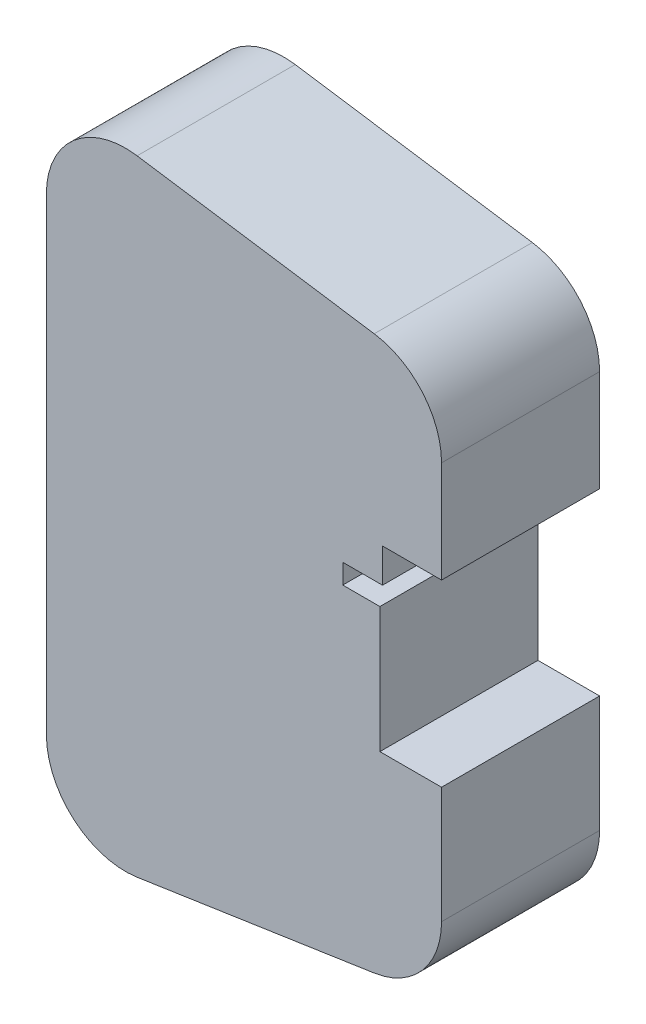
ISO-10303-21;
HEADER;
FILE_DESCRIPTION(('STEP AP214'),'2;1');
FILE_NAME('part.step','',(''),(''),'','','');
FILE_SCHEMA(('AUTOMOTIVE_DESIGN { 1 0 10303 214 1 1 1 1 }'));
ENDSEC;
DATA;
#1=APPLICATION_CONTEXT('core data for automotive mechanical design processes');
#2=APPLICATION_PROTOCOL_DEFINITION('international standard','automotive_design',2000,#1);
#3=PRODUCT_CONTEXT('',#1,'mechanical');
#4=PRODUCT('Part','Part','',(#3));
#5=PRODUCT_RELATED_PRODUCT_CATEGORY('part','',(#4));
#6=PRODUCT_DEFINITION_FORMATION('','',#4);
#7=PRODUCT_DEFINITION_CONTEXT('part definition',#1,'design');
#8=PRODUCT_DEFINITION('design','',#6,#7);
#9=PRODUCT_DEFINITION_SHAPE('','',#8);
#10=(LENGTH_UNIT() NAMED_UNIT(*) SI_UNIT(.MILLI.,.METRE.));
#11=(NAMED_UNIT(*) PLANE_ANGLE_UNIT() SI_UNIT($,.RADIAN.));
#12=(NAMED_UNIT(*) SI_UNIT($,.STERADIAN.) SOLID_ANGLE_UNIT());
#13=UNCERTAINTY_MEASURE_WITH_UNIT(LENGTH_MEASURE(1.E-05),#10,'distance_accuracy_value','');
#14=(GEOMETRIC_REPRESENTATION_CONTEXT(3) GLOBAL_UNCERTAINTY_ASSIGNED_CONTEXT((#13)) GLOBAL_UNIT_ASSIGNED_CONTEXT((#10,
#11,#12)) REPRESENTATION_CONTEXT('',''));
#15=CARTESIAN_POINT('',(0.,0.,0.));
#16=DIRECTION('',(0.,0.,1.));
#17=DIRECTION('',(1.,0.,0.));
#18=AXIS2_PLACEMENT_3D('',#15,#16,#17);
#19=CARTESIAN_POINT('',(50.,-25.1381257919217,20.));
#20=DIRECTION('',(-1.,0.,0.));
#21=DIRECTION('',(0.,0.,1.));
#22=AXIS2_PLACEMENT_3D('',#19,#20,#21);
#23=PLANE('',#22);
#24=DIRECTION('',(0.,1.,0.));
#25=VECTOR('',#24,1.);
#26=CARTESIAN_POINT('',(50.,-25.1381257919217,0.));
#27=LINE('',#26,#25);
#28=CARTESIAN_POINT('',(50.,-25.1381257919217,0.));
#29=VERTEX_POINT('',#28);
#30=CARTESIAN_POINT('',(50.,-10.4028915543573,0.));
#31=VERTEX_POINT('',#30);
#32=EDGE_CURVE('E193',#29,#31,#27,.T.);
#33=ORIENTED_EDGE('',*,*,#32,.T.);
#34=DIRECTION('',(0.,0.,1.));
#35=VECTOR('',#34,1.);
#36=CARTESIAN_POINT('',(50.,-10.4028915543573,0.));
#37=LINE('',#36,#35);
#38=CARTESIAN_POINT('',(50.,-10.4028915543573,20.));
#39=VERTEX_POINT('',#38);
#40=EDGE_CURVE('E242',#31,#39,#37,.T.);
#41=ORIENTED_EDGE('',*,*,#40,.T.);
#42=DIRECTION('',(0.,1.,0.));
#43=VECTOR('',#42,1.);
#44=CARTESIAN_POINT('',(50.,-25.1381257919217,20.));
#45=LINE('',#44,#43);
#46=CARTESIAN_POINT('',(50.,-25.1381257919217,20.));
#47=VERTEX_POINT('',#46);
#48=EDGE_CURVE('E244',#47,#39,#45,.T.);
#49=ORIENTED_EDGE('',*,*,#48,.F.);
#50=DIRECTION('',(0.,0.,-1.));
#51=VECTOR('',#50,1.);
#52=CARTESIAN_POINT('',(50.,-25.1381257919217,20.));
#53=LINE('',#52,#51);
#54=EDGE_CURVE('E224',#47,#29,#53,.T.);
#55=ORIENTED_EDGE('',*,*,#54,.T.);
#56=EDGE_LOOP('',(#33,#41,#49,#55));
#57=FACE_BOUND('',#56,.T.);
#58=ADVANCED_FACE('F32',(#57),#23,.F.);
#59=CARTESIAN_POINT('',(10.,-29.6381257919217,20.));
#60=DIRECTION('',(0.,0.,-1.));
#61=DIRECTION('',(-1.,0.,0.));
#62=AXIS2_PLACEMENT_3D('',#59,#60,#61);
#63=CYLINDRICAL_SURFACE('',#62,9.99999999999999);
#64=CARTESIAN_POINT('',(10.,-29.6381257919217,0.));
#65=DIRECTION('',(0.,0.,1.));
#66=DIRECTION('',(1.,0.,0.));
#67=AXIS2_PLACEMENT_3D('',#64,#65,#66);
#68=CIRCLE('',#67,9.99999999999999);
#69=CARTESIAN_POINT('',(0.,-29.6381257919217,0.));
#70=VERTEX_POINT('',#69);
#71=CARTESIAN_POINT('',(11.4834045293024,-39.5274893206046,0.));
#72=VERTEX_POINT('',#71);
#73=EDGE_CURVE('E258',#70,#72,#68,.T.);
#74=ORIENTED_EDGE('',*,*,#73,.T.);
#75=DIRECTION('',(0.,0.,-1.));
#76=VECTOR('',#75,1.);
#77=CARTESIAN_POINT('',(11.4834045293024,-39.5274893206046,20.));
#78=LINE('',#77,#76);
#79=CARTESIAN_POINT('',(11.4834045293024,-39.5274893206046,20.));
#80=VERTEX_POINT('',#79);
#81=EDGE_CURVE('E11',#80,#72,#78,.T.);
#82=ORIENTED_EDGE('',*,*,#81,.F.);
#83=CARTESIAN_POINT('',(10.,-29.6381257919217,20.));
#84=DIRECTION('',(0.,0.,1.));
#85=DIRECTION('',(1.,0.,0.));
#86=AXIS2_PLACEMENT_3D('',#83,#84,#85);
#87=CIRCLE('',#86,9.99999999999999);
#88=CARTESIAN_POINT('',(0.,-29.6381257919217,20.));
#89=VERTEX_POINT('',#88);
#90=EDGE_CURVE('E208',#89,#80,#87,.T.);
#91=ORIENTED_EDGE('',*,*,#90,.F.);
#92=DIRECTION('',(0.,0.,-1.));
#93=VECTOR('',#92,1.);
#94=CARTESIAN_POINT('',(0.,-29.6381257919217,20.));
#95=LINE('',#94,#93);
#96=EDGE_CURVE('E209',#89,#70,#95,.T.);
#97=ORIENTED_EDGE('',*,*,#96,.T.);
#98=EDGE_LOOP('',(#74,#82,#91,#97));
#99=FACE_BOUND('',#98,.T.);
#100=ADVANCED_FACE('F34',(#99),#63,.T.);
#101=CARTESIAN_POINT('',(41.4834045293024,-35.0274893206046,20.));
#102=DIRECTION('',(-0.148340452930245,0.988936352868298,0.));
#103=DIRECTION('',(-0.988936352868298,-0.148340452930245,0.));
#104=AXIS2_PLACEMENT_3D('',#101,#102,#103);
#105=PLANE('',#104);
#106=DIRECTION('',(0.988936352868298,0.148340452930245,0.));
#107=VECTOR('',#106,1.);
#108=CARTESIAN_POINT('',(41.4834045293024,-35.0274893206046,0.));
#109=LINE('',#108,#107);
#110=CARTESIAN_POINT('',(41.4834045293024,-35.0274893206046,0.));
#111=VERTEX_POINT('',#110);
#112=EDGE_CURVE('E197',#72,#111,#109,.T.);
#113=ORIENTED_EDGE('',*,*,#112,.T.);
#114=DIRECTION('',(0.,0.,-1.));
#115=VECTOR('',#114,1.);
#116=CARTESIAN_POINT('',(41.4834045293024,-35.0274893206046,20.));
#117=LINE('',#116,#115);
#118=CARTESIAN_POINT('',(41.4834045293024,-35.0274893206046,20.));
#119=VERTEX_POINT('',#118);
#120=EDGE_CURVE('E40',#119,#111,#117,.T.);
#121=ORIENTED_EDGE('',*,*,#120,.F.);
#122=DIRECTION('',(0.988936352868298,0.148340452930245,0.));
#123=VECTOR('',#122,1.);
#124=CARTESIAN_POINT('',(41.4834045293024,-35.0274893206046,20.));
#125=LINE('',#124,#123);
#126=EDGE_CURVE('E263',#80,#119,#125,.T.);
#127=ORIENTED_EDGE('',*,*,#126,.F.);
#128=ORIENTED_EDGE('',*,*,#81,.T.);
#129=EDGE_LOOP('',(#113,#121,#127,#128));
#130=FACE_BOUND('',#129,.T.);
#131=ADVANCED_FACE('F261',(#130),#105,.F.);
#132=CARTESIAN_POINT('',(40.,-25.1381257919217,20.));
#133=DIRECTION('',(0.,0.,-1.));
#134=DIRECTION('',(-1.,0.,0.));
#135=AXIS2_PLACEMENT_3D('',#132,#133,#134);
#136=CYLINDRICAL_SURFACE('',#135,10.);
#137=CARTESIAN_POINT('',(40.,-25.1381257919217,0.));
#138=DIRECTION('',(0.,0.,1.));
#139=DIRECTION('',(1.,0.,0.));
#140=AXIS2_PLACEMENT_3D('',#137,#138,#139);
#141=CIRCLE('',#140,10.);
#142=EDGE_CURVE('E194',#111,#29,#141,.T.);
#143=ORIENTED_EDGE('',*,*,#142,.T.);
#144=ORIENTED_EDGE('',*,*,#54,.F.);
#145=CARTESIAN_POINT('',(40.,-25.1381257919217,20.));
#146=DIRECTION('',(0.,0.,1.));
#147=DIRECTION('',(1.,0.,0.));
#148=AXIS2_PLACEMENT_3D('',#145,#146,#147);
#149=CIRCLE('',#148,10.);
#150=EDGE_CURVE('E233',#119,#47,#149,.T.);
#151=ORIENTED_EDGE('',*,*,#150,.F.);
#152=ORIENTED_EDGE('',*,*,#120,.T.);
#153=EDGE_LOOP('',(#143,#144,#151,#152));
#154=FACE_BOUND('',#153,.T.);
#155=ADVANCED_FACE('F231',(#154),#136,.T.);
#156=CARTESIAN_POINT('',(50.,12.2971084456427,20.));
#157=VERTEX_POINT('',#156);
#158=CARTESIAN_POINT('',(50.,25.1381257919217,20.));
#159=VERTEX_POINT('',#158);
#160=EDGE_CURVE('E185',#157,#159,#45,.T.);
#161=ORIENTED_EDGE('',*,*,#160,.F.);
#162=DIRECTION('',(0.,0.,1.));
#163=VECTOR('',#162,1.);
#164=CARTESIAN_POINT('',(50.,12.2971084456427,0.));
#165=LINE('',#164,#163);
#166=CARTESIAN_POINT('',(50.,12.2971084456427,0.));
#167=VERTEX_POINT('',#166);
#168=EDGE_CURVE('E172',#167,#157,#165,.T.);
#169=ORIENTED_EDGE('',*,*,#168,.F.);
#170=CARTESIAN_POINT('',(50.,25.1381257919217,0.));
#171=VERTEX_POINT('',#170);
#172=EDGE_CURVE('E183',#167,#171,#27,.T.);
#173=ORIENTED_EDGE('',*,*,#172,.T.);
#174=DIRECTION('',(0.,0.,-1.));
#175=VECTOR('',#174,1.);
#176=CARTESIAN_POINT('',(50.,25.1381257919217,20.));
#177=LINE('',#176,#175);
#178=EDGE_CURVE('E222',#159,#171,#177,.T.);
#179=ORIENTED_EDGE('',*,*,#178,.F.);
#180=EDGE_LOOP('',(#161,#169,#173,#179));
#181=FACE_BOUND('',#180,.T.);
#182=ADVANCED_FACE('F181',(#181),#23,.F.);
#183=CARTESIAN_POINT('',(40.,25.1381257919217,20.));
#184=DIRECTION('',(0.,0.,-1.));
#185=DIRECTION('',(-1.,0.,0.));
#186=AXIS2_PLACEMENT_3D('',#183,#184,#185);
#187=CYLINDRICAL_SURFACE('',#186,10.);
#188=CARTESIAN_POINT('',(40.,25.1381257919217,0.));
#189=DIRECTION('',(0.,0.,1.));
#190=DIRECTION('',(-1.,0.,0.));
#191=AXIS2_PLACEMENT_3D('',#188,#189,#190);
#192=CIRCLE('',#191,10.);
#193=CARTESIAN_POINT('',(41.4834045293024,35.0274893206046,0.));
#194=VERTEX_POINT('',#193);
#195=EDGE_CURVE('E192',#171,#194,#192,.T.);
#196=ORIENTED_EDGE('',*,*,#195,.T.);
#197=DIRECTION('',(0.,0.,-1.));
#198=VECTOR('',#197,1.);
#199=CARTESIAN_POINT('',(41.4834045293024,35.0274893206046,20.));
#200=LINE('',#199,#198);
#201=CARTESIAN_POINT('',(41.4834045293024,35.0274893206046,20.));
#202=VERTEX_POINT('',#201);
#203=EDGE_CURVE('E219',#202,#194,#200,.T.);
#204=ORIENTED_EDGE('',*,*,#203,.F.);
#205=CARTESIAN_POINT('',(40.,25.1381257919217,20.));
#206=DIRECTION('',(0.,0.,1.));
#207=DIRECTION('',(-1.,0.,0.));
#208=AXIS2_PLACEMENT_3D('',#205,#206,#207);
#209=CIRCLE('',#208,10.);
#210=EDGE_CURVE('E247',#159,#202,#209,.T.);
#211=ORIENTED_EDGE('',*,*,#210,.F.);
#212=ORIENTED_EDGE('',*,*,#178,.T.);
#213=EDGE_LOOP('',(#196,#204,#211,#212));
#214=FACE_BOUND('',#213,.T.);
#215=ADVANCED_FACE('F284',(#214),#187,.T.);
#216=CARTESIAN_POINT('',(11.4834045293024,39.5274893206046,20.));
#217=DIRECTION('',(-0.148340452930245,-0.988936352868298,0.));
#218=DIRECTION('',(0.988936352868298,-0.148340452930245,0.));
#219=AXIS2_PLACEMENT_3D('',#216,#217,#218);
#220=PLANE('',#219);
#221=DIRECTION('',(-0.988936352868298,0.148340452930245,0.));
#222=VECTOR('',#221,1.);
#223=CARTESIAN_POINT('',(11.4834045293024,39.5274893206046,0.));
#224=LINE('',#223,#222);
#225=CARTESIAN_POINT('',(11.4834045293024,39.5274893206046,0.));
#226=VERTEX_POINT('',#225);
#227=EDGE_CURVE('E202',#194,#226,#224,.T.);
#228=ORIENTED_EDGE('',*,*,#227,.T.);
#229=DIRECTION('',(0.,0.,-1.));
#230=VECTOR('',#229,1.);
#231=CARTESIAN_POINT('',(11.4834045293024,39.5274893206046,20.));
#232=LINE('',#231,#230);
#233=CARTESIAN_POINT('',(11.4834045293024,39.5274893206046,20.));
#234=VERTEX_POINT('',#233);
#235=EDGE_CURVE('E216',#234,#226,#232,.T.);
#236=ORIENTED_EDGE('',*,*,#235,.F.);
#237=DIRECTION('',(-0.988936352868298,0.148340452930245,0.));
#238=VECTOR('',#237,1.);
#239=CARTESIAN_POINT('',(11.4834045293024,39.5274893206046,20.));
#240=LINE('',#239,#238);
#241=EDGE_CURVE('E249',#202,#234,#240,.T.);
#242=ORIENTED_EDGE('',*,*,#241,.F.);
#243=ORIENTED_EDGE('',*,*,#203,.T.);
#244=EDGE_LOOP('',(#228,#236,#242,#243));
#245=FACE_BOUND('',#244,.T.);
#246=ADVANCED_FACE('F280',(#245),#220,.F.);
#247=CARTESIAN_POINT('',(10.,29.6381257919217,20.));
#248=DIRECTION('',(0.,0.,-1.));
#249=DIRECTION('',(-1.,0.,0.));
#250=AXIS2_PLACEMENT_3D('',#247,#248,#249);
#251=CYLINDRICAL_SURFACE('',#250,10.);
#252=CARTESIAN_POINT('',(10.,29.6381257919217,0.));
#253=DIRECTION('',(0.,0.,1.));
#254=DIRECTION('',(-1.,0.,0.));
#255=AXIS2_PLACEMENT_3D('',#252,#253,#254);
#256=CIRCLE('',#255,10.);
#257=CARTESIAN_POINT('',(0.,29.6381257919217,0.));
#258=VERTEX_POINT('',#257);
#259=EDGE_CURVE('E204',#226,#258,#256,.T.);
#260=ORIENTED_EDGE('',*,*,#259,.T.);
#261=DIRECTION('',(0.,0.,-1.));
#262=VECTOR('',#261,1.);
#263=CARTESIAN_POINT('',(0.,29.6381257919217,20.));
#264=LINE('',#263,#262);
#265=CARTESIAN_POINT('',(0.,29.6381257919217,20.));
#266=VERTEX_POINT('',#265);
#267=EDGE_CURVE('E212',#266,#258,#264,.T.);
#268=ORIENTED_EDGE('',*,*,#267,.F.);
#269=CARTESIAN_POINT('',(10.,29.6381257919217,20.));
#270=DIRECTION('',(0.,0.,1.));
#271=DIRECTION('',(-1.,0.,0.));
#272=AXIS2_PLACEMENT_3D('',#269,#270,#271);
#273=CIRCLE('',#272,10.);
#274=EDGE_CURVE('E255',#234,#266,#273,.T.);
#275=ORIENTED_EDGE('',*,*,#274,.F.);
#276=ORIENTED_EDGE('',*,*,#235,.T.);
#277=EDGE_LOOP('',(#260,#268,#275,#276));
#278=FACE_BOUND('',#277,.T.);
#279=ADVANCED_FACE('F276',(#278),#251,.T.);
#280=CARTESIAN_POINT('',(0.,29.6381257919217,20.));
#281=DIRECTION('',(1.,0.,0.));
#282=DIRECTION('',(0.,1.,0.));
#283=AXIS2_PLACEMENT_3D('',#280,#281,#282);
#284=PLANE('',#283);
#285=DIRECTION('',(0.,0.,1.));
#286=VECTOR('',#285,1.);
#287=CARTESIAN_POINT('',(0.,15.842836282418,5.49999999999999));
#288=LINE('',#287,#286);
#289=CARTESIAN_POINT('',(0.,15.842836282418,5.49999999999999));
#290=VERTEX_POINT('',#289);
#291=CARTESIAN_POINT('',(0.,15.842836282418,14.5));
#292=VERTEX_POINT('',#291);
#293=EDGE_CURVE('E346',#290,#292,#288,.T.);
#294=ORIENTED_EDGE('',*,*,#293,.F.);
#295=DIRECTION('',(0.,-1.,0.));
#296=VECTOR('',#295,1.);
#297=CARTESIAN_POINT('',(0.,15.842836282418,5.49999999999999));
#298=LINE('',#297,#296);
#299=CARTESIAN_POINT('',(0.,17.2971084456427,5.49999999999999));
#300=VERTEX_POINT('',#299);
#301=EDGE_CURVE('E55',#300,#290,#298,.T.);
#302=ORIENTED_EDGE('',*,*,#301,.F.);
#303=DIRECTION('',(0.,0.,-1.));
#304=VECTOR('',#303,1.);
#305=CARTESIAN_POINT('',(0.,17.2971084456427,5.49999999999999));
#306=LINE('',#305,#304);
#307=CARTESIAN_POINT('',(0.,17.2971084456427,14.5));
#308=VERTEX_POINT('',#307);
#309=EDGE_CURVE('E335',#308,#300,#306,.T.);
#310=ORIENTED_EDGE('',*,*,#309,.F.);
#311=DIRECTION('',(0.,1.,0.));
#312=VECTOR('',#311,1.);
#313=CARTESIAN_POINT('',(0.,17.2971084456427,14.5));
#314=LINE('',#313,#312);
#315=EDGE_CURVE('E349',#292,#308,#314,.T.);
#316=ORIENTED_EDGE('',*,*,#315,.F.);
#317=EDGE_LOOP('',(#294,#302,#310,#316));
#318=FACE_BOUND('',#317,.T.);
#319=DIRECTION('',(0.,-1.,0.));
#320=VECTOR('',#319,1.);
#321=CARTESIAN_POINT('',(0.,29.6381257919217,0.));
#322=LINE('',#321,#320);
#323=EDGE_CURVE('E206',#258,#70,#322,.T.);
#324=ORIENTED_EDGE('',*,*,#323,.T.);
#325=ORIENTED_EDGE('',*,*,#96,.F.);
#326=DIRECTION('',(0.,-1.,0.));
#327=VECTOR('',#326,1.);
#328=CARTESIAN_POINT('',(0.,29.6381257919217,20.));
#329=LINE('',#328,#327);
#330=EDGE_CURVE('E213',#266,#89,#329,.T.);
#331=ORIENTED_EDGE('',*,*,#330,.F.);
#332=ORIENTED_EDGE('',*,*,#267,.T.);
#333=EDGE_LOOP('',(#324,#325,#331,#332));
#334=FACE_BOUND('',#333,.T.);
#335=ADVANCED_FACE('F271',(#318,#334),#284,.F.);
#336=CARTESIAN_POINT('',(10.,-29.6381257919217,20.));
#337=DIRECTION('',(0.,0.,1.));
#338=DIRECTION('',(1.,0.,0.));
#339=AXIS2_PLACEMENT_3D('',#336,#337,#338);
#340=PLANE('',#339);
#341=DIRECTION('',(1.,0.,0.));
#342=VECTOR('',#341,1.);
#343=CARTESIAN_POINT('',(42.2,-10.4028915543573,20.));
#344=LINE('',#343,#342);
#345=CARTESIAN_POINT('',(42.2,-10.4028915543573,20.));
#346=VERTEX_POINT('',#345);
#347=EDGE_CURVE('E177',#346,#39,#344,.T.);
#348=ORIENTED_EDGE('',*,*,#347,.F.);
#349=DIRECTION('',(0.,-1.,0.));
#350=VECTOR('',#349,1.);
#351=CARTESIAN_POINT('',(42.2,5.49710844564269,20.));
#352=LINE('',#351,#350);
#353=CARTESIAN_POINT('',(42.2,5.49710844564269,20.));
#354=VERTEX_POINT('',#353);
#355=EDGE_CURVE('E309',#354,#346,#352,.T.);
#356=ORIENTED_EDGE('',*,*,#355,.F.);
#357=DIRECTION('',(1.,0.,0.));
#358=VECTOR('',#357,1.);
#359=CARTESIAN_POINT('',(42.2,5.49710844564269,20.));
#360=LINE('',#359,#358);
#361=CARTESIAN_POINT('',(37.5,5.49710844564268,20.));
#362=VERTEX_POINT('',#361);
#363=EDGE_CURVE('E306',#362,#354,#360,.T.);
#364=ORIENTED_EDGE('',*,*,#363,.F.);
#365=DIRECTION('',(0.,-1.,0.));
#366=VECTOR('',#365,1.);
#367=CARTESIAN_POINT('',(37.5,5.49710844564268,20.));
#368=LINE('',#367,#366);
#369=CARTESIAN_POINT('',(37.5,7.99710844564268,20.));
#370=VERTEX_POINT('',#369);
#371=EDGE_CURVE('E303',#370,#362,#368,.T.);
#372=ORIENTED_EDGE('',*,*,#371,.F.);
#373=DIRECTION('',(-1.,0.,0.));
#374=VECTOR('',#373,1.);
#375=CARTESIAN_POINT('',(37.5,7.99710844564268,20.));
#376=LINE('',#375,#374);
#377=CARTESIAN_POINT('',(42.53,7.99710844564268,20.));
#378=VERTEX_POINT('',#377);
#379=EDGE_CURVE('E293',#378,#370,#376,.T.);
#380=ORIENTED_EDGE('',*,*,#379,.F.);
#381=DIRECTION('',(0.,-1.,0.));
#382=VECTOR('',#381,1.);
#383=CARTESIAN_POINT('',(42.53,7.99710844564268,20.));
#384=LINE('',#383,#382);
#385=CARTESIAN_POINT('',(42.53,12.2971084456427,20.));
#386=VERTEX_POINT('',#385);
#387=EDGE_CURVE('E290',#386,#378,#384,.T.);
#388=ORIENTED_EDGE('',*,*,#387,.F.);
#389=DIRECTION('',(-1.,0.,0.));
#390=VECTOR('',#389,1.);
#391=CARTESIAN_POINT('',(42.53,12.2971084456427,20.));
#392=LINE('',#391,#390);
#393=EDGE_CURVE('E287',#157,#386,#392,.T.);
#394=ORIENTED_EDGE('',*,*,#393,.F.);
#395=ORIENTED_EDGE('',*,*,#160,.T.);
#396=ORIENTED_EDGE('',*,*,#210,.T.);
#397=ORIENTED_EDGE('',*,*,#241,.T.);
#398=ORIENTED_EDGE('',*,*,#274,.T.);
#399=ORIENTED_EDGE('',*,*,#330,.T.);
#400=ORIENTED_EDGE('',*,*,#90,.T.);
#401=ORIENTED_EDGE('',*,*,#126,.T.);
#402=ORIENTED_EDGE('',*,*,#150,.T.);
#403=ORIENTED_EDGE('',*,*,#48,.T.);
#404=EDGE_LOOP('',(#348,#356,#364,#372,#380,#388,#394,#395,#396,#397,#398,#399,#400,#401,#402,#403));
#405=FACE_BOUND('',#404,.T.);
#406=ADVANCED_FACE('F285',(#405),#340,.T.);
#407=CARTESIAN_POINT('',(10.,-29.6381257919217,0.));
#408=DIRECTION('',(0.,0.,1.));
#409=DIRECTION('',(1.,0.,0.));
#410=AXIS2_PLACEMENT_3D('',#407,#408,#409);
#411=PLANE('',#410);
#412=DIRECTION('',(0.,-1.,0.));
#413=VECTOR('',#412,1.);
#414=CARTESIAN_POINT('',(42.2,5.49710844564269,0.));
#415=LINE('',#414,#413);
#416=CARTESIAN_POINT('',(42.2,5.49710844564269,0.));
#417=VERTEX_POINT('',#416);
#418=CARTESIAN_POINT('',(42.2,-10.4028915543573,0.));
#419=VERTEX_POINT('',#418);
#420=EDGE_CURVE('E619',#417,#419,#415,.T.);
#421=ORIENTED_EDGE('',*,*,#420,.T.);
#422=DIRECTION('',(1.,0.,0.));
#423=VECTOR('',#422,1.);
#424=CARTESIAN_POINT('',(42.2,-10.4028915543573,0.));
#425=LINE('',#424,#423);
#426=EDGE_CURVE('E186',#419,#31,#425,.T.);
#427=ORIENTED_EDGE('',*,*,#426,.T.);
#428=ORIENTED_EDGE('',*,*,#32,.F.);
#429=ORIENTED_EDGE('',*,*,#142,.F.);
#430=ORIENTED_EDGE('',*,*,#112,.F.);
#431=ORIENTED_EDGE('',*,*,#73,.F.);
#432=ORIENTED_EDGE('',*,*,#323,.F.);
#433=ORIENTED_EDGE('',*,*,#259,.F.);
#434=ORIENTED_EDGE('',*,*,#227,.F.);
#435=ORIENTED_EDGE('',*,*,#195,.F.);
#436=ORIENTED_EDGE('',*,*,#172,.F.);
#437=DIRECTION('',(-1.,0.,0.));
#438=VECTOR('',#437,1.);
#439=CARTESIAN_POINT('',(42.53,12.2971084456427,0.));
#440=LINE('',#439,#438);
#441=CARTESIAN_POINT('',(42.53,12.2971084456427,0.));
#442=VERTEX_POINT('',#441);
#443=EDGE_CURVE('E168',#167,#442,#440,.T.);
#444=ORIENTED_EDGE('',*,*,#443,.T.);
#445=DIRECTION('',(0.,-1.,0.));
#446=VECTOR('',#445,1.);
#447=CARTESIAN_POINT('',(42.53,7.99710844564268,0.));
#448=LINE('',#447,#446);
#449=CARTESIAN_POINT('',(42.53,7.99710844564268,0.));
#450=VERTEX_POINT('',#449);
#451=EDGE_CURVE('E47',#442,#450,#448,.T.);
#452=ORIENTED_EDGE('',*,*,#451,.T.);
#453=DIRECTION('',(-1.,0.,0.));
#454=VECTOR('',#453,1.);
#455=CARTESIAN_POINT('',(37.5,7.99710844564268,0.));
#456=LINE('',#455,#454);
#457=CARTESIAN_POINT('',(37.5,7.99710844564268,0.));
#458=VERTEX_POINT('',#457);
#459=EDGE_CURVE('E611',#450,#458,#456,.T.);
#460=ORIENTED_EDGE('',*,*,#459,.T.);
#461=DIRECTION('',(0.,-1.,0.));
#462=VECTOR('',#461,1.);
#463=CARTESIAN_POINT('',(37.5,5.49710844564268,0.));
#464=LINE('',#463,#462);
#465=CARTESIAN_POINT('',(37.5,5.49710844564268,0.));
#466=VERTEX_POINT('',#465);
#467=EDGE_CURVE('E614',#458,#466,#464,.T.);
#468=ORIENTED_EDGE('',*,*,#467,.T.);
#469=DIRECTION('',(1.,0.,0.));
#470=VECTOR('',#469,1.);
#471=CARTESIAN_POINT('',(42.2,5.49710844564269,0.));
#472=LINE('',#471,#470);
#473=EDGE_CURVE('E617',#466,#417,#472,.T.);
#474=ORIENTED_EDGE('',*,*,#473,.T.);
#475=EDGE_LOOP('',(#421,#427,#428,#429,#430,#431,#432,#433,#434,#435,#436,#444,#452,#460,#468,#474));
#476=FACE_BOUND('',#475,.T.);
#477=ADVANCED_FACE('F190',(#476),#411,.F.);
#478=CARTESIAN_POINT('',(10.,15.842836282418,5.49999999999999));
#479=DIRECTION('',(0.,0.,-1.));
#480=DIRECTION('',(-1.,0.,0.));
#481=AXIS2_PLACEMENT_3D('',#478,#479,#480);
#482=PLANE('',#481);
#483=ORIENTED_EDGE('',*,*,#301,.T.);
#484=DIRECTION('',(-1.,0.,0.));
#485=VECTOR('',#484,1.);
#486=CARTESIAN_POINT('',(10.,15.842836282418,5.49999999999999));
#487=LINE('',#486,#485);
#488=CARTESIAN_POINT('',(10.,15.842836282418,5.49999999999999));
#489=VERTEX_POINT('',#488);
#490=EDGE_CURVE('E344',#489,#290,#487,.T.);
#491=ORIENTED_EDGE('',*,*,#490,.F.);
#492=DIRECTION('',(0.,-1.,0.));
#493=VECTOR('',#492,1.);
#494=CARTESIAN_POINT('',(10.,15.842836282418,5.49999999999999));
#495=LINE('',#494,#493);
#496=CARTESIAN_POINT('',(10.,17.2971084456427,5.49999999999999));
#497=VERTEX_POINT('',#496);
#498=EDGE_CURVE('E331',#497,#489,#495,.T.);
#499=ORIENTED_EDGE('',*,*,#498,.F.);
#500=DIRECTION('',(-1.,0.,0.));
#501=VECTOR('',#500,1.);
#502=CARTESIAN_POINT('',(10.,17.2971084456427,5.49999999999999));
#503=LINE('',#502,#501);
#504=EDGE_CURVE('E260',#497,#300,#503,.T.);
#505=ORIENTED_EDGE('',*,*,#504,.T.);
#506=EDGE_LOOP('',(#483,#491,#499,#505));
#507=FACE_BOUND('',#506,.T.);
#508=ADVANCED_FACE('F374',(#507),#482,.F.);
#509=CARTESIAN_POINT('',(10.,17.2971084456427,5.49999999999999));
#510=DIRECTION('',(0.,1.,0.));
#511=DIRECTION('',(0.,0.,1.));
#512=AXIS2_PLACEMENT_3D('',#509,#510,#511);
#513=PLANE('',#512);
#514=CARTESIAN_POINT('',(2.64487157528492,17.2971084456427,9.99999999999999));
#515=DIRECTION('',(0.,-1.,0.));
#516=DIRECTION('',(0.,0.,-1.));
#517=AXIS2_PLACEMENT_3D('',#514,#515,#516);
#518=CIRCLE('',#517,0.5);
#519=CARTESIAN_POINT('',(2.64487157528492,17.2971084456427,9.49999999999999));
#520=VERTEX_POINT('',#519);
#521=EDGE_CURVE('E314',#520,#520,#518,.T.);
#522=ORIENTED_EDGE('',*,*,#521,.F.);
#523=EDGE_LOOP('',(#522));
#524=FACE_BOUND('',#523,.T.);
#525=ORIENTED_EDGE('',*,*,#309,.T.);
#526=ORIENTED_EDGE('',*,*,#504,.F.);
#527=DIRECTION('',(0.,0.,-1.));
#528=VECTOR('',#527,1.);
#529=CARTESIAN_POINT('',(10.,17.2971084456427,5.49999999999999));
#530=LINE('',#529,#528);
#531=CARTESIAN_POINT('',(10.,17.2971084456427,14.5));
#532=VERTEX_POINT('',#531);
#533=EDGE_CURVE('E341',#532,#497,#530,.T.);
#534=ORIENTED_EDGE('',*,*,#533,.F.);
#535=DIRECTION('',(-1.,0.,0.));
#536=VECTOR('',#535,1.);
#537=CARTESIAN_POINT('',(10.,17.2971084456427,14.5));
#538=LINE('',#537,#536);
#539=EDGE_CURVE('E355',#532,#308,#538,.T.);
#540=ORIENTED_EDGE('',*,*,#539,.T.);
#541=EDGE_LOOP('',(#525,#526,#534,#540));
#542=FACE_BOUND('',#541,.T.);
#543=ADVANCED_FACE('F376',(#524,#542),#513,.F.);
#544=CARTESIAN_POINT('',(10.,17.2971084456427,14.5));
#545=DIRECTION('',(0.,0.,1.));
#546=DIRECTION('',(1.,0.,0.));
#547=AXIS2_PLACEMENT_3D('',#544,#545,#546);
#548=PLANE('',#547);
#549=ORIENTED_EDGE('',*,*,#315,.T.);
#550=ORIENTED_EDGE('',*,*,#539,.F.);
#551=DIRECTION('',(0.,1.,0.));
#552=VECTOR('',#551,1.);
#553=CARTESIAN_POINT('',(10.,17.2971084456427,14.5));
#554=LINE('',#553,#552);
#555=CARTESIAN_POINT('',(10.,15.842836282418,14.5));
#556=VERTEX_POINT('',#555);
#557=EDGE_CURVE('E338',#556,#532,#554,.T.);
#558=ORIENTED_EDGE('',*,*,#557,.F.);
#559=DIRECTION('',(-1.,0.,0.));
#560=VECTOR('',#559,1.);
#561=CARTESIAN_POINT('',(10.,15.842836282418,14.5));
#562=LINE('',#561,#560);
#563=EDGE_CURVE('E357',#556,#292,#562,.T.);
#564=ORIENTED_EDGE('',*,*,#563,.T.);
#565=EDGE_LOOP('',(#549,#550,#558,#564));
#566=FACE_BOUND('',#565,.T.);
#567=ADVANCED_FACE('F369',(#566),#548,.F.);
#568=CARTESIAN_POINT('',(10.,15.842836282418,5.49999999999999));
#569=DIRECTION('',(0.,-1.,0.));
#570=DIRECTION('',(0.,0.,-1.));
#571=AXIS2_PLACEMENT_3D('',#568,#569,#570);
#572=PLANE('',#571);
#573=ORIENTED_EDGE('',*,*,#293,.T.);
#574=ORIENTED_EDGE('',*,*,#563,.F.);
#575=DIRECTION('',(0.,0.,1.));
#576=VECTOR('',#575,1.);
#577=CARTESIAN_POINT('',(10.,15.842836282418,5.49999999999999));
#578=LINE('',#577,#576);
#579=EDGE_CURVE('E334',#489,#556,#578,.T.);
#580=ORIENTED_EDGE('',*,*,#579,.F.);
#581=ORIENTED_EDGE('',*,*,#490,.T.);
#582=EDGE_LOOP('',(#573,#574,#580,#581));
#583=FACE_BOUND('',#582,.T.);
#584=ADVANCED_FACE('F363',(#583),#572,.F.);
#585=CARTESIAN_POINT('',(10.,0.,0.));
#586=DIRECTION('',(1.,0.,0.));
#587=DIRECTION('',(0.,0.,-1.));
#588=AXIS2_PLACEMENT_3D('',#585,#586,#587);
#589=PLANE('',#588);
#590=ORIENTED_EDGE('',*,*,#498,.T.);
#591=ORIENTED_EDGE('',*,*,#579,.T.);
#592=ORIENTED_EDGE('',*,*,#557,.T.);
#593=ORIENTED_EDGE('',*,*,#533,.T.);
#594=EDGE_LOOP('',(#590,#591,#592,#593));
#595=FACE_BOUND('',#594,.T.);
#596=ADVANCED_FACE('F373',(#595),#589,.F.);
#597=CARTESIAN_POINT('',(2.64487157528492,22.2971084456427,9.99999999999999));
#598=DIRECTION('',(0.,-1.,0.));
#599=DIRECTION('',(0.,0.,-1.));
#600=AXIS2_PLACEMENT_3D('',#597,#598,#599);
#601=CYLINDRICAL_SURFACE('',#600,0.5);
#602=CARTESIAN_POINT('',(2.64487157528492,22.2971084456427,9.99999999999999));
#603=DIRECTION('',(0.,-1.,0.));
#604=DIRECTION('',(0.,0.,-1.));
#605=AXIS2_PLACEMENT_3D('',#602,#603,#604);
#606=CIRCLE('',#605,0.5);
#607=CARTESIAN_POINT('',(2.64487157528492,22.2971084456427,9.49999999999999));
#608=VERTEX_POINT('',#607);
#609=EDGE_CURVE('E326',#608,#608,#606,.T.);
#610=ORIENTED_EDGE('',*,*,#609,.F.);
#611=EDGE_LOOP('',(#610));
#612=FACE_BOUND('',#611,.T.);
#613=ORIENTED_EDGE('',*,*,#521,.T.);
#614=EDGE_LOOP('',(#613));
#615=FACE_BOUND('',#614,.T.);
#616=ADVANCED_FACE('F492',(#612,#615),#601,.F.);
#617=CARTESIAN_POINT('',(2.64487157528492,22.2971084456427,9.99999999999999));
#618=DIRECTION('',(0.,-1.,0.));
#619=DIRECTION('',(0.,0.,-1.));
#620=AXIS2_PLACEMENT_3D('',#617,#618,#619);
#621=PLANE('',#620);
#622=ORIENTED_EDGE('',*,*,#609,.T.);
#623=EDGE_LOOP('',(#622));
#624=FACE_BOUND('',#623,.T.);
#625=ADVANCED_FACE('F498',(#624),#621,.T.);
#626=CARTESIAN_POINT('',(42.2,-10.4028915543573,0.));
#627=DIRECTION('',(0.,-1.,0.));
#628=DIRECTION('',(1.,0.,0.));
#629=AXIS2_PLACEMENT_3D('',#626,#627,#628);
#630=PLANE('',#629);
#631=ORIENTED_EDGE('',*,*,#347,.T.);
#632=ORIENTED_EDGE('',*,*,#40,.F.);
#633=ORIENTED_EDGE('',*,*,#426,.F.);
#634=DIRECTION('',(0.,0.,1.));
#635=VECTOR('',#634,1.);
#636=CARTESIAN_POINT('',(42.2,-10.4028915543573,0.));
#637=LINE('',#636,#635);
#638=EDGE_CURVE('E315',#419,#346,#637,.T.);
#639=ORIENTED_EDGE('',*,*,#638,.T.);
#640=EDGE_LOOP('',(#631,#632,#633,#639));
#641=FACE_BOUND('',#640,.T.);
#642=ADVANCED_FACE('F507',(#641),#630,.F.);
#643=CARTESIAN_POINT('',(42.2,5.49710844564269,0.));
#644=DIRECTION('',(-1.,0.,0.));
#645=DIRECTION('',(0.,0.,1.));
#646=AXIS2_PLACEMENT_3D('',#643,#644,#645);
#647=PLANE('',#646);
#648=ORIENTED_EDGE('',*,*,#355,.T.);
#649=ORIENTED_EDGE('',*,*,#638,.F.);
#650=ORIENTED_EDGE('',*,*,#420,.F.);
#651=DIRECTION('',(0.,0.,1.));
#652=VECTOR('',#651,1.);
#653=CARTESIAN_POINT('',(42.2,5.49710844564269,0.));
#654=LINE('',#653,#652);
#655=EDGE_CURVE('E317',#417,#354,#654,.T.);
#656=ORIENTED_EDGE('',*,*,#655,.T.);
#657=EDGE_LOOP('',(#648,#649,#650,#656));
#658=FACE_BOUND('',#657,.T.);
#659=ADVANCED_FACE('F519',(#658),#647,.F.);
#660=CARTESIAN_POINT('',(42.2,5.49710844564269,0.));
#661=DIRECTION('',(0.,-1.,0.));
#662=DIRECTION('',(1.,0.,0.));
#663=AXIS2_PLACEMENT_3D('',#660,#661,#662);
#664=PLANE('',#663);
#665=ORIENTED_EDGE('',*,*,#363,.T.);
#666=ORIENTED_EDGE('',*,*,#655,.F.);
#667=ORIENTED_EDGE('',*,*,#473,.F.);
#668=DIRECTION('',(0.,0.,1.));
#669=VECTOR('',#668,1.);
#670=CARTESIAN_POINT('',(37.5,5.49710844564268,0.));
#671=LINE('',#670,#669);
#672=EDGE_CURVE('E319',#466,#362,#671,.T.);
#673=ORIENTED_EDGE('',*,*,#672,.T.);
#674=EDGE_LOOP('',(#665,#666,#667,#673));
#675=FACE_BOUND('',#674,.T.);
#676=ADVANCED_FACE('F528',(#675),#664,.F.);
#677=CARTESIAN_POINT('',(37.5,5.49710844564268,0.));
#678=DIRECTION('',(-1.,0.,0.));
#679=DIRECTION('',(0.,0.,1.));
#680=AXIS2_PLACEMENT_3D('',#677,#678,#679);
#681=PLANE('',#680);
#682=ORIENTED_EDGE('',*,*,#371,.T.);
#683=ORIENTED_EDGE('',*,*,#672,.F.);
#684=ORIENTED_EDGE('',*,*,#467,.F.);
#685=DIRECTION('',(0.,0.,1.));
#686=VECTOR('',#685,1.);
#687=CARTESIAN_POINT('',(37.5,7.99710844564268,0.));
#688=LINE('',#687,#686);
#689=EDGE_CURVE('E321',#458,#370,#688,.T.);
#690=ORIENTED_EDGE('',*,*,#689,.T.);
#691=EDGE_LOOP('',(#682,#683,#684,#690));
#692=FACE_BOUND('',#691,.T.);
#693=ADVANCED_FACE('F537',(#692),#681,.F.);
#694=CARTESIAN_POINT('',(37.5,7.99710844564268,0.));
#695=DIRECTION('',(0.,1.,0.));
#696=DIRECTION('',(0.,0.,1.));
#697=AXIS2_PLACEMENT_3D('',#694,#695,#696);
#698=PLANE('',#697);
#699=CARTESIAN_POINT('',(40.23,7.99710844564268,10.));
#700=DIRECTION('',(0.,-1.,0.));
#701=DIRECTION('',(0.,0.,-1.));
#702=AXIS2_PLACEMENT_3D('',#699,#700,#701);
#703=CIRCLE('',#702,0.999999999999998);
#704=CARTESIAN_POINT('',(40.23,7.99710844564268,9.));
#705=VERTEX_POINT('',#704);
#706=EDGE_CURVE('E296',#705,#705,#703,.T.);
#707=ORIENTED_EDGE('',*,*,#706,.F.);
#708=EDGE_LOOP('',(#707));
#709=FACE_BOUND('',#708,.T.);
#710=ORIENTED_EDGE('',*,*,#379,.T.);
#711=ORIENTED_EDGE('',*,*,#689,.F.);
#712=ORIENTED_EDGE('',*,*,#459,.F.);
#713=DIRECTION('',(0.,0.,1.));
#714=VECTOR('',#713,1.);
#715=CARTESIAN_POINT('',(42.53,7.99710844564268,0.));
#716=LINE('',#715,#714);
#717=EDGE_CURVE('E323',#450,#378,#716,.T.);
#718=ORIENTED_EDGE('',*,*,#717,.T.);
#719=EDGE_LOOP('',(#710,#711,#712,#718));
#720=FACE_BOUND('',#719,.T.);
#721=ADVANCED_FACE('F546',(#709,#720),#698,.F.);
#722=CARTESIAN_POINT('',(42.53,7.99710844564268,0.));
#723=DIRECTION('',(-1.,0.,0.));
#724=DIRECTION('',(0.,0.,1.));
#725=AXIS2_PLACEMENT_3D('',#722,#723,#724);
#726=PLANE('',#725);
#727=ORIENTED_EDGE('',*,*,#387,.T.);
#728=ORIENTED_EDGE('',*,*,#717,.F.);
#729=ORIENTED_EDGE('',*,*,#451,.F.);
#730=DIRECTION('',(0.,0.,1.));
#731=VECTOR('',#730,1.);
#732=CARTESIAN_POINT('',(42.53,12.2971084456427,0.));
#733=LINE('',#732,#731);
#734=EDGE_CURVE('E174',#442,#386,#733,.T.);
#735=ORIENTED_EDGE('',*,*,#734,.T.);
#736=EDGE_LOOP('',(#727,#728,#729,#735));
#737=FACE_BOUND('',#736,.T.);
#738=ADVANCED_FACE('F556',(#737),#726,.F.);
#739=CARTESIAN_POINT('',(42.53,12.2971084456427,0.));
#740=DIRECTION('',(0.,1.,0.));
#741=DIRECTION('',(0.,0.,1.));
#742=AXIS2_PLACEMENT_3D('',#739,#740,#741);
#743=PLANE('',#742);
#744=ORIENTED_EDGE('',*,*,#393,.T.);
#745=ORIENTED_EDGE('',*,*,#734,.F.);
#746=ORIENTED_EDGE('',*,*,#443,.F.);
#747=ORIENTED_EDGE('',*,*,#168,.T.);
#748=EDGE_LOOP('',(#744,#745,#746,#747));
#749=FACE_BOUND('',#748,.T.);
#750=ADVANCED_FACE('F171',(#749),#743,.F.);
#751=CARTESIAN_POINT('',(40.23,12.9971084456427,10.));
#752=DIRECTION('',(0.,-1.,0.));
#753=DIRECTION('',(0.,0.,-1.));
#754=AXIS2_PLACEMENT_3D('',#751,#752,#753);
#755=CYLINDRICAL_SURFACE('',#754,0.999999999999998);
#756=CARTESIAN_POINT('',(40.23,12.9971084456427,10.));
#757=DIRECTION('',(0.,-1.,0.));
#758=DIRECTION('',(0.,0.,-1.));
#759=AXIS2_PLACEMENT_3D('',#756,#757,#758);
#760=CIRCLE('',#759,0.999999999999998);
#761=CARTESIAN_POINT('',(40.23,12.9971084456427,9.));
#762=VERTEX_POINT('',#761);
#763=EDGE_CURVE('E291',#762,#762,#760,.T.);
#764=ORIENTED_EDGE('',*,*,#763,.F.);
#765=EDGE_LOOP('',(#764));
#766=FACE_BOUND('',#765,.T.);
#767=ORIENTED_EDGE('',*,*,#706,.T.);
#768=EDGE_LOOP('',(#767));
#769=FACE_BOUND('',#768,.T.);
#770=ADVANCED_FACE('F572',(#766,#769),#755,.F.);
#771=CARTESIAN_POINT('',(40.23,12.9971084456427,10.));
#772=DIRECTION('',(0.,-1.,0.));
#773=DIRECTION('',(0.,0.,-1.));
#774=AXIS2_PLACEMENT_3D('',#771,#772,#773);
#775=PLANE('',#774);
#776=ORIENTED_EDGE('',*,*,#763,.T.);
#777=EDGE_LOOP('',(#776));
#778=FACE_BOUND('',#777,.T.);
#779=ADVANCED_FACE('F579',(#778),#775,.T.);
#780=CLOSED_SHELL('',(#58,#100,#131,#155,#182,#215,#246,#279,#335,#406,#477,#508,#543,#567,#584,
#596,#616,#625,#642,#659,#676,#693,#721,#738,#750,#770,#779));
#781=MANIFOLD_SOLID_BREP('B2',#780);
#782=ADVANCED_BREP_SHAPE_REPRESENTATION('',(#18,#781),#14);
#783=SHAPE_DEFINITION_REPRESENTATION(#9,#782);
ENDSEC;
END-ISO-10303-21;
